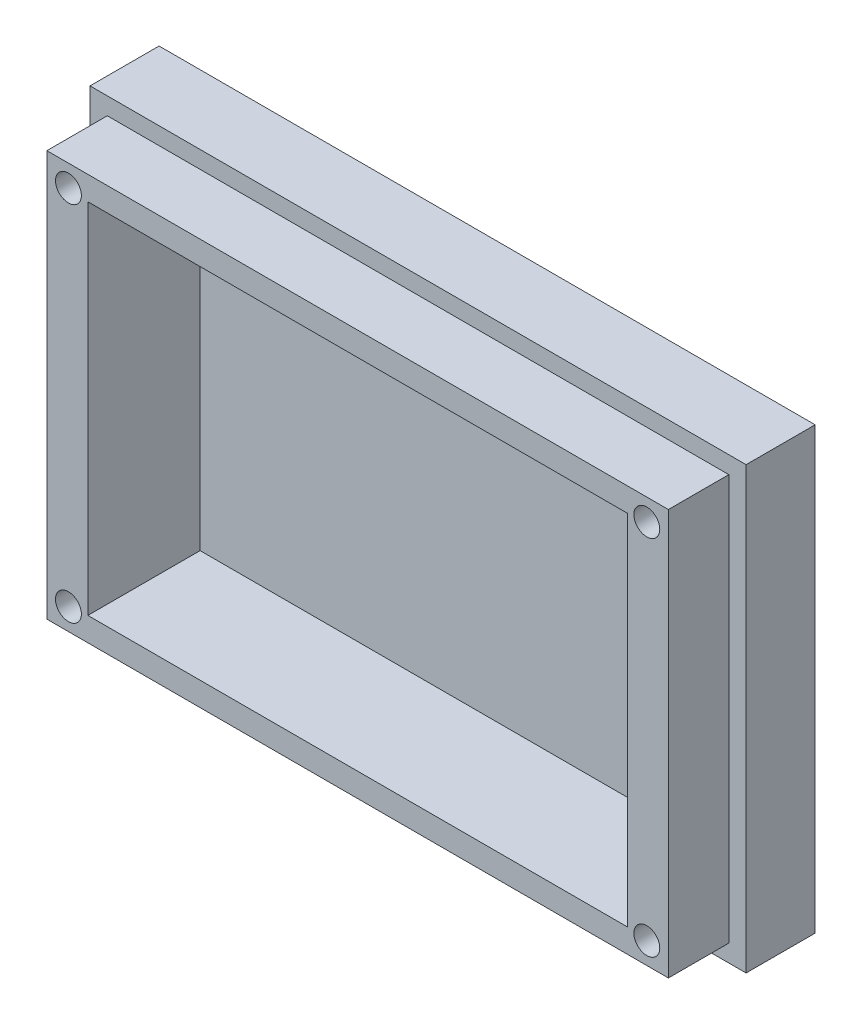
ISO-10303-21;
HEADER;
FILE_DESCRIPTION(('STEP AP214'),'2;1');
FILE_NAME('part.step','',(''),(''),'','','');
FILE_SCHEMA(('AUTOMOTIVE_DESIGN { 1 0 10303 214 1 1 1 1 }'));
ENDSEC;
DATA;
#1=APPLICATION_CONTEXT('core data for automotive mechanical design processes');
#2=APPLICATION_PROTOCOL_DEFINITION('international standard','automotive_design',2000,#1);
#3=PRODUCT_CONTEXT('',#1,'mechanical');
#4=PRODUCT('Part','Part','',(#3));
#5=PRODUCT_RELATED_PRODUCT_CATEGORY('part','',(#4));
#6=PRODUCT_DEFINITION_FORMATION('','',#4);
#7=PRODUCT_DEFINITION_CONTEXT('part definition',#1,'design');
#8=PRODUCT_DEFINITION('design','',#6,#7);
#9=PRODUCT_DEFINITION_SHAPE('','',#8);
#10=(LENGTH_UNIT() NAMED_UNIT(*) SI_UNIT(.MILLI.,.METRE.));
#11=(NAMED_UNIT(*) PLANE_ANGLE_UNIT() SI_UNIT($,.RADIAN.));
#12=(NAMED_UNIT(*) SI_UNIT($,.STERADIAN.) SOLID_ANGLE_UNIT());
#13=UNCERTAINTY_MEASURE_WITH_UNIT(LENGTH_MEASURE(1.E-05),#10,'distance_accuracy_value','');
#14=(GEOMETRIC_REPRESENTATION_CONTEXT(3) GLOBAL_UNCERTAINTY_ASSIGNED_CONTEXT((#13)) GLOBAL_UNIT_ASSIGNED_CONTEXT((#10,
#11,#12)) REPRESENTATION_CONTEXT('',''));
#15=CARTESIAN_POINT('',(0.,0.,0.));
#16=DIRECTION('',(0.,0.,1.));
#17=DIRECTION('',(1.,0.,0.));
#18=AXIS2_PLACEMENT_3D('',#15,#16,#17);
#19=CARTESIAN_POINT('',(-33.9726727110203,27.3979057591623,15.));
#20=DIRECTION('',(1.,0.,0.));
#21=DIRECTION('',(0.,0.,-1.));
#22=AXIS2_PLACEMENT_3D('',#19,#20,#21);
#23=PLANE('',#22);
#24=DIRECTION('',(0.,1.,0.));
#25=VECTOR('',#24,1.);
#26=CARTESIAN_POINT('',(-33.9726727110203,27.3979057591623,8.));
#27=LINE('',#26,#25);
#28=CARTESIAN_POINT('',(-33.9726727110203,-19.6020942408377,8.));
#29=VERTEX_POINT('',#28);
#30=CARTESIAN_POINT('',(-33.9726727110203,27.3979057591623,8.));
#31=VERTEX_POINT('',#30);
#32=EDGE_CURVE('E47',#29,#31,#27,.T.);
#33=ORIENTED_EDGE('',*,*,#32,.F.);
#34=DIRECTION('',(0.,0.,-1.));
#35=VECTOR('',#34,1.);
#36=CARTESIAN_POINT('',(-33.9726727110203,-19.6020942408377,15.));
#37=LINE('',#36,#35);
#38=CARTESIAN_POINT('',(-33.9726727110203,-19.6020942408377,15.));
#39=VERTEX_POINT('',#38);
#40=EDGE_CURVE('E11',#39,#29,#37,.T.);
#41=ORIENTED_EDGE('',*,*,#40,.F.);
#42=DIRECTION('',(0.,-1.,0.));
#43=VECTOR('',#42,1.);
#44=CARTESIAN_POINT('',(-33.9726727110203,27.3979057591623,15.));
#45=LINE('',#44,#43);
#46=CARTESIAN_POINT('',(-33.9726727110203,27.3979057591623,15.));
#47=VERTEX_POINT('',#46);
#48=EDGE_CURVE('E227',#47,#39,#45,.T.);
#49=ORIENTED_EDGE('',*,*,#48,.F.);
#50=DIRECTION('',(0.,0.,-1.));
#51=VECTOR('',#50,1.);
#52=CARTESIAN_POINT('',(-33.9726727110203,27.3979057591623,15.));
#53=LINE('',#52,#51);
#54=EDGE_CURVE('E132',#47,#31,#53,.T.);
#55=ORIENTED_EDGE('',*,*,#54,.T.);
#56=EDGE_LOOP('',(#33,#41,#49,#55));
#57=FACE_BOUND('',#56,.T.);
#58=ADVANCED_FACE('F33',(#57),#23,.F.);
#59=CARTESIAN_POINT('',(-33.9726727110203,-19.6020942408377,15.));
#60=DIRECTION('',(0.,1.,0.));
#61=DIRECTION('',(0.,0.,1.));
#62=AXIS2_PLACEMENT_3D('',#59,#60,#61);
#63=PLANE('',#62);
#64=DIRECTION('',(-1.,0.,0.));
#65=VECTOR('',#64,1.);
#66=CARTESIAN_POINT('',(38.0273272889797,-19.6020942408377,8.));
#67=LINE('',#66,#65);
#68=CARTESIAN_POINT('',(38.0273272889797,-19.6020942408377,8.));
#69=VERTEX_POINT('',#68);
#70=EDGE_CURVE('E53',#69,#29,#67,.T.);
#71=ORIENTED_EDGE('',*,*,#70,.F.);
#72=DIRECTION('',(0.,0.,-1.));
#73=VECTOR('',#72,1.);
#74=CARTESIAN_POINT('',(38.0273272889797,-19.6020942408377,15.));
#75=LINE('',#74,#73);
#76=CARTESIAN_POINT('',(38.0273272889797,-19.6020942408377,15.));
#77=VERTEX_POINT('',#76);
#78=EDGE_CURVE('E40',#77,#69,#75,.T.);
#79=ORIENTED_EDGE('',*,*,#78,.F.);
#80=DIRECTION('',(1.,0.,0.));
#81=VECTOR('',#80,1.);
#82=CARTESIAN_POINT('',(-33.9726727110203,-19.6020942408377,15.));
#83=LINE('',#82,#81);
#84=EDGE_CURVE('E236',#39,#77,#83,.T.);
#85=ORIENTED_EDGE('',*,*,#84,.F.);
#86=ORIENTED_EDGE('',*,*,#40,.T.);
#87=EDGE_LOOP('',(#71,#79,#85,#86));
#88=FACE_BOUND('',#87,.T.);
#89=ADVANCED_FACE('F244',(#88),#63,.F.);
#90=CARTESIAN_POINT('',(38.0273272889797,27.3979057591623,15.));
#91=DIRECTION('',(-1.,0.,0.));
#92=DIRECTION('',(0.,0.,1.));
#93=AXIS2_PLACEMENT_3D('',#90,#91,#92);
#94=PLANE('',#93);
#95=DIRECTION('',(0.,-1.,0.));
#96=VECTOR('',#95,1.);
#97=CARTESIAN_POINT('',(38.0273272889797,27.3979057591623,8.));
#98=LINE('',#97,#96);
#99=CARTESIAN_POINT('',(38.0273272889797,27.3979057591623,8.));
#100=VERTEX_POINT('',#99);
#101=EDGE_CURVE('E135',#100,#69,#98,.T.);
#102=ORIENTED_EDGE('',*,*,#101,.F.);
#103=DIRECTION('',(0.,0.,-1.));
#104=VECTOR('',#103,1.);
#105=CARTESIAN_POINT('',(38.0273272889797,27.3979057591623,15.));
#106=LINE('',#105,#104);
#107=CARTESIAN_POINT('',(38.0273272889797,27.3979057591623,15.));
#108=VERTEX_POINT('',#107);
#109=EDGE_CURVE('E123',#108,#100,#106,.T.);
#110=ORIENTED_EDGE('',*,*,#109,.F.);
#111=DIRECTION('',(0.,1.,0.));
#112=VECTOR('',#111,1.);
#113=CARTESIAN_POINT('',(38.0273272889797,27.3979057591623,15.));
#114=LINE('',#113,#112);
#115=EDGE_CURVE('E238',#77,#108,#114,.T.);
#116=ORIENTED_EDGE('',*,*,#115,.F.);
#117=ORIENTED_EDGE('',*,*,#78,.T.);
#118=EDGE_LOOP('',(#102,#110,#116,#117));
#119=FACE_BOUND('',#118,.T.);
#120=ADVANCED_FACE('F136',(#119),#94,.F.);
#121=CARTESIAN_POINT('',(-33.9726727110203,27.3979057591623,15.));
#122=DIRECTION('',(0.,-1.,0.));
#123=DIRECTION('',(0.,0.,-1.));
#124=AXIS2_PLACEMENT_3D('',#121,#122,#123);
#125=PLANE('',#124);
#126=DIRECTION('',(1.,0.,0.));
#127=VECTOR('',#126,1.);
#128=CARTESIAN_POINT('',(38.0273272889797,27.3979057591623,8.));
#129=LINE('',#128,#127);
#130=EDGE_CURVE('E128',#31,#100,#129,.T.);
#131=ORIENTED_EDGE('',*,*,#130,.F.);
#132=ORIENTED_EDGE('',*,*,#54,.F.);
#133=DIRECTION('',(-1.,0.,0.));
#134=VECTOR('',#133,1.);
#135=CARTESIAN_POINT('',(-33.9726727110203,27.3979057591623,15.));
#136=LINE('',#135,#134);
#137=EDGE_CURVE('E129',#108,#47,#136,.T.);
#138=ORIENTED_EDGE('',*,*,#137,.F.);
#139=ORIENTED_EDGE('',*,*,#109,.T.);
#140=EDGE_LOOP('',(#131,#132,#138,#139));
#141=FACE_BOUND('',#140,.T.);
#142=ADVANCED_FACE('F125',(#141),#125,.F.);
#143=CARTESIAN_POINT('',(0.,0.,15.));
#144=DIRECTION('',(0.,0.,1.));
#145=DIRECTION('',(1.,0.,0.));
#146=AXIS2_PLACEMENT_3D('',#143,#144,#145);
#147=PLANE('',#146);
#148=CARTESIAN_POINT('',(35.5273272889797,24.8979057591623,15.));
#149=DIRECTION('',(0.,0.,1.));
#150=DIRECTION('',(1.,0.,0.));
#151=AXIS2_PLACEMENT_3D('',#148,#149,#150);
#152=CIRCLE('',#151,1.5);
#153=CARTESIAN_POINT('',(37.0273272889797,24.8979057591623,15.));
#154=VERTEX_POINT('',#153);
#155=EDGE_CURVE('E188',#154,#154,#152,.T.);
#156=ORIENTED_EDGE('',*,*,#155,.F.);
#157=EDGE_LOOP('',(#156));
#158=FACE_BOUND('',#157,.T.);
#159=CARTESIAN_POINT('',(-31.4726727110199,-17.1020942408377,15.));
#160=DIRECTION('',(0.,0.,1.));
#161=DIRECTION('',(1.,0.,0.));
#162=AXIS2_PLACEMENT_3D('',#159,#160,#161);
#163=CIRCLE('',#162,1.5);
#164=CARTESIAN_POINT('',(-29.9726727110199,-17.1020942408377,15.));
#165=VERTEX_POINT('',#164);
#166=EDGE_CURVE('E181',#165,#165,#163,.T.);
#167=ORIENTED_EDGE('',*,*,#166,.F.);
#168=EDGE_LOOP('',(#167));
#169=FACE_BOUND('',#168,.T.);
#170=CARTESIAN_POINT('',(35.5273272889801,-17.1020942408377,15.));
#171=DIRECTION('',(0.,0.,1.));
#172=DIRECTION('',(1.,0.,0.));
#173=AXIS2_PLACEMENT_3D('',#170,#171,#172);
#174=CIRCLE('',#173,1.5);
#175=CARTESIAN_POINT('',(37.0273272889801,-17.1020942408377,15.));
#176=VERTEX_POINT('',#175);
#177=EDGE_CURVE('E172',#176,#176,#174,.T.);
#178=ORIENTED_EDGE('',*,*,#177,.F.);
#179=EDGE_LOOP('',(#178));
#180=FACE_BOUND('',#179,.T.);
#181=CARTESIAN_POINT('',(-31.4726727110203,24.8979057591623,15.));
#182=DIRECTION('',(0.,0.,1.));
#183=DIRECTION('',(1.,0.,0.));
#184=AXIS2_PLACEMENT_3D('',#181,#182,#183);
#185=CIRCLE('',#184,1.5);
#186=CARTESIAN_POINT('',(-29.9726727110203,24.8979057591623,15.));
#187=VERTEX_POINT('',#186);
#188=EDGE_CURVE('E187',#187,#187,#185,.T.);
#189=ORIENTED_EDGE('',*,*,#188,.F.);
#190=EDGE_LOOP('',(#189));
#191=FACE_BOUND('',#190,.T.);
#192=DIRECTION('',(0.,-1.,0.));
#193=VECTOR('',#192,1.);
#194=CARTESIAN_POINT('',(-29.2226727110203,24.6479057591623,15.));
#195=LINE('',#194,#193);
#196=CARTESIAN_POINT('',(-29.2226727110203,24.6479057591623,15.));
#197=VERTEX_POINT('',#196);
#198=CARTESIAN_POINT('',(-29.2226727110203,-16.8520942408377,15.));
#199=VERTEX_POINT('',#198);
#200=EDGE_CURVE('E199',#197,#199,#195,.T.);
#201=ORIENTED_EDGE('',*,*,#200,.F.);
#202=DIRECTION('',(-1.,0.,0.));
#203=VECTOR('',#202,1.);
#204=CARTESIAN_POINT('',(-29.2226727110203,24.6479057591623,15.));
#205=LINE('',#204,#203);
#206=CARTESIAN_POINT('',(33.2773272889797,24.6479057591623,15.));
#207=VERTEX_POINT('',#206);
#208=EDGE_CURVE('E206',#207,#197,#205,.T.);
#209=ORIENTED_EDGE('',*,*,#208,.F.);
#210=DIRECTION('',(0.,1.,0.));
#211=VECTOR('',#210,1.);
#212=CARTESIAN_POINT('',(33.2773272889797,24.6479057591623,15.));
#213=LINE('',#212,#211);
#214=CARTESIAN_POINT('',(33.2773272889797,-16.8520942408377,15.));
#215=VERTEX_POINT('',#214);
#216=EDGE_CURVE('E220',#215,#207,#213,.T.);
#217=ORIENTED_EDGE('',*,*,#216,.F.);
#218=DIRECTION('',(1.,0.,0.));
#219=VECTOR('',#218,1.);
#220=CARTESIAN_POINT('',(-29.2226727110203,-16.8520942408377,15.));
#221=LINE('',#220,#219);
#222=EDGE_CURVE('E217',#199,#215,#221,.T.);
#223=ORIENTED_EDGE('',*,*,#222,.F.);
#224=EDGE_LOOP('',(#201,#209,#217,#223));
#225=FACE_BOUND('',#224,.T.);
#226=ORIENTED_EDGE('',*,*,#48,.T.);
#227=ORIENTED_EDGE('',*,*,#84,.T.);
#228=ORIENTED_EDGE('',*,*,#115,.T.);
#229=ORIENTED_EDGE('',*,*,#137,.T.);
#230=EDGE_LOOP('',(#226,#227,#228,#229));
#231=FACE_BOUND('',#230,.T.);
#232=ADVANCED_FACE('F243',(#158,#169,#180,#191,#225,#231),#147,.T.);
#233=CARTESIAN_POINT('',(0.,0.,0.));
#234=DIRECTION('',(0.,0.,1.));
#235=DIRECTION('',(1.,0.,0.));
#236=AXIS2_PLACEMENT_3D('',#233,#234,#235);
#237=PLANE('',#236);
#238=CARTESIAN_POINT('',(35.5273272889797,24.8979057591623,0.));
#239=DIRECTION('',(0.,0.,1.));
#240=DIRECTION('',(1.,0.,0.));
#241=AXIS2_PLACEMENT_3D('',#238,#239,#240);
#242=CIRCLE('',#241,1.5);
#243=CARTESIAN_POINT('',(37.0273272889797,24.8979057591623,0.));
#244=VERTEX_POINT('',#243);
#245=EDGE_CURVE('E184',#244,#244,#242,.T.);
#246=ORIENTED_EDGE('',*,*,#245,.T.);
#247=EDGE_LOOP('',(#246));
#248=FACE_BOUND('',#247,.T.);
#249=CARTESIAN_POINT('',(-31.4726727110199,-17.1020942408377,0.));
#250=DIRECTION('',(0.,0.,1.));
#251=DIRECTION('',(1.,0.,0.));
#252=AXIS2_PLACEMENT_3D('',#249,#250,#251);
#253=CIRCLE('',#252,1.5);
#254=CARTESIAN_POINT('',(-29.9726727110199,-17.1020942408377,0.));
#255=VERTEX_POINT('',#254);
#256=EDGE_CURVE('E191',#255,#255,#253,.T.);
#257=ORIENTED_EDGE('',*,*,#256,.T.);
#258=EDGE_LOOP('',(#257));
#259=FACE_BOUND('',#258,.T.);
#260=CARTESIAN_POINT('',(35.5273272889801,-17.1020942408377,0.));
#261=DIRECTION('',(0.,0.,1.));
#262=DIRECTION('',(1.,0.,0.));
#263=AXIS2_PLACEMENT_3D('',#260,#261,#262);
#264=CIRCLE('',#263,1.5);
#265=CARTESIAN_POINT('',(37.0273272889801,-17.1020942408377,0.));
#266=VERTEX_POINT('',#265);
#267=EDGE_CURVE('E178',#266,#266,#264,.T.);
#268=ORIENTED_EDGE('',*,*,#267,.T.);
#269=EDGE_LOOP('',(#268));
#270=FACE_BOUND('',#269,.T.);
#271=CARTESIAN_POINT('',(-31.4726727110203,24.8979057591623,0.));
#272=DIRECTION('',(0.,0.,1.));
#273=DIRECTION('',(1.,0.,0.));
#274=AXIS2_PLACEMENT_3D('',#271,#272,#273);
#275=CIRCLE('',#274,1.5);
#276=CARTESIAN_POINT('',(-29.9726727110203,24.8979057591623,0.));
#277=VERTEX_POINT('',#276);
#278=EDGE_CURVE('E196',#277,#277,#275,.T.);
#279=ORIENTED_EDGE('',*,*,#278,.T.);
#280=EDGE_LOOP('',(#279));
#281=FACE_BOUND('',#280,.T.);
#282=DIRECTION('',(0.,-1.,0.));
#283=VECTOR('',#282,1.);
#284=CARTESIAN_POINT('',(40.0273272889797,29.3979057591623,0.));
#285=LINE('',#284,#283);
#286=CARTESIAN_POINT('',(40.0273272889797,29.3979057591623,0.));
#287=VERTEX_POINT('',#286);
#288=CARTESIAN_POINT('',(40.0273272889797,-21.6020942408377,0.));
#289=VERTEX_POINT('',#288);
#290=EDGE_CURVE('E141',#287,#289,#285,.T.);
#291=ORIENTED_EDGE('',*,*,#290,.T.);
#292=DIRECTION('',(-1.,0.,0.));
#293=VECTOR('',#292,1.);
#294=CARTESIAN_POINT('',(40.0273272889797,-21.6020942408377,0.));
#295=LINE('',#294,#293);
#296=CARTESIAN_POINT('',(-35.9726727110203,-21.6020942408377,0.));
#297=VERTEX_POINT('',#296);
#298=EDGE_CURVE('E144',#289,#297,#295,.T.);
#299=ORIENTED_EDGE('',*,*,#298,.T.);
#300=DIRECTION('',(0.,1.,0.));
#301=VECTOR('',#300,1.);
#302=CARTESIAN_POINT('',(-35.9726727110203,29.3979057591623,0.));
#303=LINE('',#302,#301);
#304=CARTESIAN_POINT('',(-35.9726727110203,29.3979057591623,0.));
#305=VERTEX_POINT('',#304);
#306=EDGE_CURVE('E165',#297,#305,#303,.T.);
#307=ORIENTED_EDGE('',*,*,#306,.T.);
#308=DIRECTION('',(1.,0.,0.));
#309=VECTOR('',#308,1.);
#310=CARTESIAN_POINT('',(40.0273272889797,29.3979057591623,0.));
#311=LINE('',#310,#309);
#312=EDGE_CURVE('E153',#305,#287,#311,.T.);
#313=ORIENTED_EDGE('',*,*,#312,.T.);
#314=EDGE_LOOP('',(#291,#299,#307,#313));
#315=FACE_BOUND('',#314,.T.);
#316=ADVANCED_FACE('F254',(#248,#259,#270,#281,#315),#237,.F.);
#317=CARTESIAN_POINT('',(-29.2226727110203,24.6479057591623,2.));
#318=DIRECTION('',(-1.,0.,0.));
#319=DIRECTION('',(0.,-1.,0.));
#320=AXIS2_PLACEMENT_3D('',#317,#318,#319);
#321=PLANE('',#320);
#322=ORIENTED_EDGE('',*,*,#200,.T.);
#323=DIRECTION('',(0.,0.,1.));
#324=VECTOR('',#323,1.);
#325=CARTESIAN_POINT('',(-29.2226727110203,-16.8520942408377,2.));
#326=LINE('',#325,#324);
#327=CARTESIAN_POINT('',(-29.2226727110203,-16.8520942408377,2.));
#328=VERTEX_POINT('',#327);
#329=EDGE_CURVE('E215',#328,#199,#326,.T.);
#330=ORIENTED_EDGE('',*,*,#329,.F.);
#331=DIRECTION('',(0.,-1.,0.));
#332=VECTOR('',#331,1.);
#333=CARTESIAN_POINT('',(-29.2226727110203,24.6479057591623,2.));
#334=LINE('',#333,#332);
#335=CARTESIAN_POINT('',(-29.2226727110203,24.6479057591623,2.));
#336=VERTEX_POINT('',#335);
#337=EDGE_CURVE('E202',#336,#328,#334,.T.);
#338=ORIENTED_EDGE('',*,*,#337,.F.);
#339=DIRECTION('',(0.,0.,1.));
#340=VECTOR('',#339,1.);
#341=CARTESIAN_POINT('',(-29.2226727110203,24.6479057591623,2.));
#342=LINE('',#341,#340);
#343=EDGE_CURVE('E225',#336,#197,#342,.T.);
#344=ORIENTED_EDGE('',*,*,#343,.T.);
#345=EDGE_LOOP('',(#322,#330,#338,#344));
#346=FACE_BOUND('',#345,.T.);
#347=ADVANCED_FACE('F257',(#346),#321,.F.);
#348=CARTESIAN_POINT('',(-29.2226727110203,24.6479057591623,2.));
#349=DIRECTION('',(0.,1.,0.));
#350=DIRECTION('',(0.,0.,1.));
#351=AXIS2_PLACEMENT_3D('',#348,#349,#350);
#352=PLANE('',#351);
#353=ORIENTED_EDGE('',*,*,#208,.T.);
#354=ORIENTED_EDGE('',*,*,#343,.F.);
#355=DIRECTION('',(-1.,0.,0.));
#356=VECTOR('',#355,1.);
#357=CARTESIAN_POINT('',(-29.2226727110203,24.6479057591623,2.));
#358=LINE('',#357,#356);
#359=CARTESIAN_POINT('',(33.2773272889797,24.6479057591623,2.));
#360=VERTEX_POINT('',#359);
#361=EDGE_CURVE('E212',#360,#336,#358,.T.);
#362=ORIENTED_EDGE('',*,*,#361,.F.);
#363=DIRECTION('',(0.,0.,1.));
#364=VECTOR('',#363,1.);
#365=CARTESIAN_POINT('',(33.2773272889797,24.6479057591623,2.));
#366=LINE('',#365,#364);
#367=EDGE_CURVE('E228',#360,#207,#366,.T.);
#368=ORIENTED_EDGE('',*,*,#367,.T.);
#369=EDGE_LOOP('',(#353,#354,#362,#368));
#370=FACE_BOUND('',#369,.T.);
#371=ADVANCED_FACE('F264',(#370),#352,.F.);
#372=CARTESIAN_POINT('',(33.2773272889797,24.6479057591623,2.));
#373=DIRECTION('',(1.,0.,0.));
#374=DIRECTION('',(0.,1.,0.));
#375=AXIS2_PLACEMENT_3D('',#372,#373,#374);
#376=PLANE('',#375);
#377=ORIENTED_EDGE('',*,*,#216,.T.);
#378=ORIENTED_EDGE('',*,*,#367,.F.);
#379=DIRECTION('',(0.,1.,0.));
#380=VECTOR('',#379,1.);
#381=CARTESIAN_POINT('',(33.2773272889797,24.6479057591623,2.));
#382=LINE('',#381,#380);
#383=CARTESIAN_POINT('',(33.2773272889797,-16.8520942408377,2.));
#384=VERTEX_POINT('',#383);
#385=EDGE_CURVE('E209',#384,#360,#382,.T.);
#386=ORIENTED_EDGE('',*,*,#385,.F.);
#387=DIRECTION('',(0.,0.,1.));
#388=VECTOR('',#387,1.);
#389=CARTESIAN_POINT('',(33.2773272889797,-16.8520942408377,2.));
#390=LINE('',#389,#388);
#391=EDGE_CURVE('E230',#384,#215,#390,.T.);
#392=ORIENTED_EDGE('',*,*,#391,.T.);
#393=EDGE_LOOP('',(#377,#378,#386,#392));
#394=FACE_BOUND('',#393,.T.);
#395=ADVANCED_FACE('F270',(#394),#376,.F.);
#396=CARTESIAN_POINT('',(-29.2226727110203,-16.8520942408377,2.));
#397=DIRECTION('',(0.,-1.,0.));
#398=DIRECTION('',(0.,0.,-1.));
#399=AXIS2_PLACEMENT_3D('',#396,#397,#398);
#400=PLANE('',#399);
#401=ORIENTED_EDGE('',*,*,#222,.T.);
#402=ORIENTED_EDGE('',*,*,#391,.F.);
#403=DIRECTION('',(1.,0.,0.));
#404=VECTOR('',#403,1.);
#405=CARTESIAN_POINT('',(-29.2226727110203,-16.8520942408377,2.));
#406=LINE('',#405,#404);
#407=EDGE_CURVE('E205',#328,#384,#406,.T.);
#408=ORIENTED_EDGE('',*,*,#407,.F.);
#409=ORIENTED_EDGE('',*,*,#329,.T.);
#410=EDGE_LOOP('',(#401,#402,#408,#409));
#411=FACE_BOUND('',#410,.T.);
#412=ADVANCED_FACE('F266',(#411),#400,.F.);
#413=CARTESIAN_POINT('',(0.,0.,2.));
#414=DIRECTION('',(0.,0.,1.));
#415=DIRECTION('',(1.,0.,0.));
#416=AXIS2_PLACEMENT_3D('',#413,#414,#415);
#417=PLANE('',#416);
#418=ORIENTED_EDGE('',*,*,#337,.T.);
#419=ORIENTED_EDGE('',*,*,#407,.T.);
#420=ORIENTED_EDGE('',*,*,#385,.T.);
#421=ORIENTED_EDGE('',*,*,#361,.T.);
#422=EDGE_LOOP('',(#418,#419,#420,#421));
#423=FACE_BOUND('',#422,.T.);
#424=ADVANCED_FACE('F269',(#423),#417,.T.);
#425=CARTESIAN_POINT('',(-31.4726727110203,24.8979057591623,0.));
#426=DIRECTION('',(0.,0.,1.));
#427=DIRECTION('',(1.,0.,0.));
#428=AXIS2_PLACEMENT_3D('',#425,#426,#427);
#429=CYLINDRICAL_SURFACE('',#428,1.5);
#430=ORIENTED_EDGE('',*,*,#278,.F.);
#431=EDGE_LOOP('',(#430));
#432=FACE_BOUND('',#431,.T.);
#433=ORIENTED_EDGE('',*,*,#188,.T.);
#434=EDGE_LOOP('',(#433));
#435=FACE_BOUND('',#434,.T.);
#436=ADVANCED_FACE('F280',(#432,#435),#429,.F.);
#437=CARTESIAN_POINT('',(35.5273272889801,-17.1020942408377,0.));
#438=DIRECTION('',(0.,0.,1.));
#439=DIRECTION('',(1.,0.,0.));
#440=AXIS2_PLACEMENT_3D('',#437,#438,#439);
#441=CYLINDRICAL_SURFACE('',#440,1.5);
#442=ORIENTED_EDGE('',*,*,#267,.F.);
#443=EDGE_LOOP('',(#442));
#444=FACE_BOUND('',#443,.T.);
#445=ORIENTED_EDGE('',*,*,#177,.T.);
#446=EDGE_LOOP('',(#445));
#447=FACE_BOUND('',#446,.T.);
#448=ADVANCED_FACE('F284',(#444,#447),#441,.F.);
#449=CARTESIAN_POINT('',(-31.4726727110199,-17.1020942408377,0.));
#450=DIRECTION('',(0.,0.,1.));
#451=DIRECTION('',(1.,0.,0.));
#452=AXIS2_PLACEMENT_3D('',#449,#450,#451);
#453=CYLINDRICAL_SURFACE('',#452,1.5);
#454=ORIENTED_EDGE('',*,*,#256,.F.);
#455=EDGE_LOOP('',(#454));
#456=FACE_BOUND('',#455,.T.);
#457=ORIENTED_EDGE('',*,*,#166,.T.);
#458=EDGE_LOOP('',(#457));
#459=FACE_BOUND('',#458,.T.);
#460=ADVANCED_FACE('F286',(#456,#459),#453,.F.);
#461=CARTESIAN_POINT('',(35.5273272889797,24.8979057591623,0.));
#462=DIRECTION('',(0.,0.,1.));
#463=DIRECTION('',(1.,0.,0.));
#464=AXIS2_PLACEMENT_3D('',#461,#462,#463);
#465=CYLINDRICAL_SURFACE('',#464,1.5);
#466=ORIENTED_EDGE('',*,*,#245,.F.);
#467=EDGE_LOOP('',(#466));
#468=FACE_BOUND('',#467,.T.);
#469=ORIENTED_EDGE('',*,*,#155,.T.);
#470=EDGE_LOOP('',(#469));
#471=FACE_BOUND('',#470,.T.);
#472=ADVANCED_FACE('F289',(#468,#471),#465,.F.);
#473=CARTESIAN_POINT('',(40.0273272889797,29.3979057591623,8.));
#474=DIRECTION('',(1.,0.,0.));
#475=DIRECTION('',(0.,1.,0.));
#476=AXIS2_PLACEMENT_3D('',#473,#474,#475);
#477=PLANE('',#476);
#478=ORIENTED_EDGE('',*,*,#290,.F.);
#479=DIRECTION('',(0.,0.,-1.));
#480=VECTOR('',#479,1.);
#481=CARTESIAN_POINT('',(40.0273272889797,29.3979057591623,8.));
#482=LINE('',#481,#480);
#483=CARTESIAN_POINT('',(40.0273272889797,29.3979057591623,8.));
#484=VERTEX_POINT('',#483);
#485=EDGE_CURVE('E170',#484,#287,#482,.T.);
#486=ORIENTED_EDGE('',*,*,#485,.F.);
#487=DIRECTION('',(0.,-1.,0.));
#488=VECTOR('',#487,1.);
#489=CARTESIAN_POINT('',(40.0273272889797,29.3979057591623,8.));
#490=LINE('',#489,#488);
#491=CARTESIAN_POINT('',(40.0273272889797,-21.6020942408377,8.));
#492=VERTEX_POINT('',#491);
#493=EDGE_CURVE('E149',#484,#492,#490,.T.);
#494=ORIENTED_EDGE('',*,*,#493,.T.);
#495=DIRECTION('',(0.,0.,-1.));
#496=VECTOR('',#495,1.);
#497=CARTESIAN_POINT('',(40.0273272889797,-21.6020942408377,8.));
#498=LINE('',#497,#496);
#499=EDGE_CURVE('E161',#492,#289,#498,.T.);
#500=ORIENTED_EDGE('',*,*,#499,.T.);
#501=EDGE_LOOP('',(#478,#486,#494,#500));
#502=FACE_BOUND('',#501,.T.);
#503=ADVANCED_FACE('F293',(#502),#477,.T.);
#504=CARTESIAN_POINT('',(40.0273272889797,29.3979057591623,8.));
#505=DIRECTION('',(0.,1.,0.));
#506=DIRECTION('',(0.,0.,1.));
#507=AXIS2_PLACEMENT_3D('',#504,#505,#506);
#508=PLANE('',#507);
#509=ORIENTED_EDGE('',*,*,#312,.F.);
#510=DIRECTION('',(0.,0.,-1.));
#511=VECTOR('',#510,1.);
#512=CARTESIAN_POINT('',(-35.9726727110203,29.3979057591623,8.));
#513=LINE('',#512,#511);
#514=CARTESIAN_POINT('',(-35.9726727110203,29.3979057591623,8.));
#515=VERTEX_POINT('',#514);
#516=EDGE_CURVE('E173',#515,#305,#513,.T.);
#517=ORIENTED_EDGE('',*,*,#516,.F.);
#518=DIRECTION('',(1.,0.,0.));
#519=VECTOR('',#518,1.);
#520=CARTESIAN_POINT('',(40.0273272889797,29.3979057591623,8.));
#521=LINE('',#520,#519);
#522=EDGE_CURVE('E159',#515,#484,#521,.T.);
#523=ORIENTED_EDGE('',*,*,#522,.T.);
#524=ORIENTED_EDGE('',*,*,#485,.T.);
#525=EDGE_LOOP('',(#509,#517,#523,#524));
#526=FACE_BOUND('',#525,.T.);
#527=ADVANCED_FACE('F300',(#526),#508,.T.);
#528=CARTESIAN_POINT('',(-35.9726727110203,29.3979057591623,8.));
#529=DIRECTION('',(-1.,0.,0.));
#530=DIRECTION('',(0.,-1.,0.));
#531=AXIS2_PLACEMENT_3D('',#528,#529,#530);
#532=PLANE('',#531);
#533=ORIENTED_EDGE('',*,*,#306,.F.);
#534=DIRECTION('',(0.,0.,-1.));
#535=VECTOR('',#534,1.);
#536=CARTESIAN_POINT('',(-35.9726727110203,-21.6020942408377,8.));
#537=LINE('',#536,#535);
#538=CARTESIAN_POINT('',(-35.9726727110203,-21.6020942408377,8.));
#539=VERTEX_POINT('',#538);
#540=EDGE_CURVE('E175',#539,#297,#537,.T.);
#541=ORIENTED_EDGE('',*,*,#540,.F.);
#542=DIRECTION('',(0.,1.,0.));
#543=VECTOR('',#542,1.);
#544=CARTESIAN_POINT('',(-35.9726727110203,29.3979057591623,8.));
#545=LINE('',#544,#543);
#546=EDGE_CURVE('E156',#539,#515,#545,.T.);
#547=ORIENTED_EDGE('',*,*,#546,.T.);
#548=ORIENTED_EDGE('',*,*,#516,.T.);
#549=EDGE_LOOP('',(#533,#541,#547,#548));
#550=FACE_BOUND('',#549,.T.);
#551=ADVANCED_FACE('F305',(#550),#532,.T.);
#552=CARTESIAN_POINT('',(40.0273272889797,-21.6020942408377,8.));
#553=DIRECTION('',(0.,-1.,0.));
#554=DIRECTION('',(0.,0.,-1.));
#555=AXIS2_PLACEMENT_3D('',#552,#553,#554);
#556=PLANE('',#555);
#557=ORIENTED_EDGE('',*,*,#298,.F.);
#558=ORIENTED_EDGE('',*,*,#499,.F.);
#559=DIRECTION('',(-1.,0.,0.));
#560=VECTOR('',#559,1.);
#561=CARTESIAN_POINT('',(40.0273272889797,-21.6020942408377,8.));
#562=LINE('',#561,#560);
#563=EDGE_CURVE('E152',#492,#539,#562,.T.);
#564=ORIENTED_EDGE('',*,*,#563,.T.);
#565=ORIENTED_EDGE('',*,*,#540,.T.);
#566=EDGE_LOOP('',(#557,#558,#564,#565));
#567=FACE_BOUND('',#566,.T.);
#568=ADVANCED_FACE('F302',(#567),#556,.T.);
#569=CARTESIAN_POINT('',(0.,0.,8.));
#570=DIRECTION('',(0.,0.,-1.));
#571=DIRECTION('',(-1.,0.,0.));
#572=AXIS2_PLACEMENT_3D('',#569,#570,#571);
#573=PLANE('',#572);
#574=ORIENTED_EDGE('',*,*,#130,.T.);
#575=ORIENTED_EDGE('',*,*,#101,.T.);
#576=ORIENTED_EDGE('',*,*,#70,.T.);
#577=ORIENTED_EDGE('',*,*,#32,.T.);
#578=EDGE_LOOP('',(#574,#575,#576,#577));
#579=FACE_BOUND('',#578,.T.);
#580=ORIENTED_EDGE('',*,*,#493,.F.);
#581=ORIENTED_EDGE('',*,*,#522,.F.);
#582=ORIENTED_EDGE('',*,*,#546,.F.);
#583=ORIENTED_EDGE('',*,*,#563,.F.);
#584=EDGE_LOOP('',(#580,#581,#582,#583));
#585=FACE_BOUND('',#584,.T.);
#586=ADVANCED_FACE('F139',(#579,#585),#573,.F.);
#587=CLOSED_SHELL('',(#58,#89,#120,#142,#232,#316,#347,#371,#395,#412,#424,#436,#448,#460,#472,
#503,#527,#551,#568,#586));
#588=MANIFOLD_SOLID_BREP('B2',#587);
#589=ADVANCED_BREP_SHAPE_REPRESENTATION('',(#18,#588),#14);
#590=SHAPE_DEFINITION_REPRESENTATION(#9,#589);
ENDSEC;
END-ISO-10303-21;
